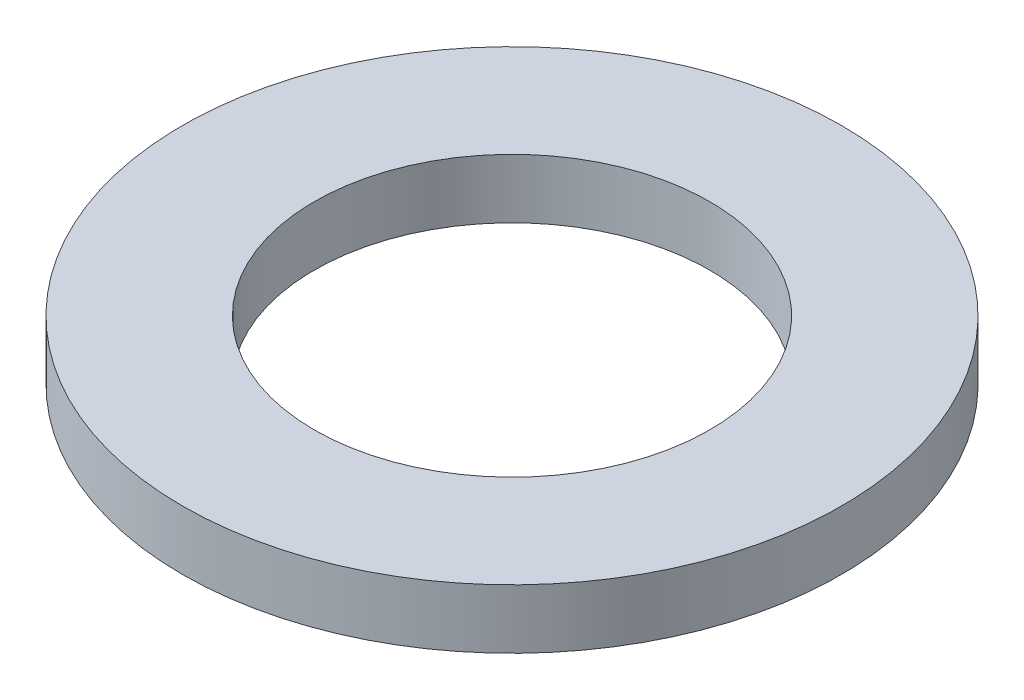
ISO-10303-21;
HEADER;
FILE_DESCRIPTION(('STEP AP214'),'2;1');
FILE_NAME('part.step','',(''),(''),'','','');
FILE_SCHEMA(('AUTOMOTIVE_DESIGN { 1 0 10303 214 1 1 1 1 }'));
ENDSEC;
DATA;
#1=APPLICATION_CONTEXT('core data for automotive mechanical design processes');
#2=APPLICATION_PROTOCOL_DEFINITION('international standard','automotive_design',2000,#1);
#3=PRODUCT_CONTEXT('',#1,'mechanical');
#4=PRODUCT('Part','Part','',(#3));
#5=PRODUCT_RELATED_PRODUCT_CATEGORY('part','',(#4));
#6=PRODUCT_DEFINITION_FORMATION('','',#4);
#7=PRODUCT_DEFINITION_CONTEXT('part definition',#1,'design');
#8=PRODUCT_DEFINITION('design','',#6,#7);
#9=PRODUCT_DEFINITION_SHAPE('','',#8);
#10=(LENGTH_UNIT() NAMED_UNIT(*) SI_UNIT(.MILLI.,.METRE.));
#11=(NAMED_UNIT(*) PLANE_ANGLE_UNIT() SI_UNIT($,.RADIAN.));
#12=(NAMED_UNIT(*) SI_UNIT($,.STERADIAN.) SOLID_ANGLE_UNIT());
#13=UNCERTAINTY_MEASURE_WITH_UNIT(LENGTH_MEASURE(1.E-05),#10,'distance_accuracy_value','');
#14=(GEOMETRIC_REPRESENTATION_CONTEXT(3) GLOBAL_UNCERTAINTY_ASSIGNED_CONTEXT((#13)) GLOBAL_UNIT_ASSIGNED_CONTEXT((#10,
#11,#12)) REPRESENTATION_CONTEXT('',''));
#15=CARTESIAN_POINT('',(0.,0.,0.));
#16=DIRECTION('',(0.,0.,1.));
#17=DIRECTION('',(1.,0.,0.));
#18=AXIS2_PLACEMENT_3D('',#15,#16,#17);
#19=CARTESIAN_POINT('',(0.,9.,0.));
#20=DIRECTION('',(0.,-1.,0.));
#21=DIRECTION('',(0.,0.,-1.));
#22=AXIS2_PLACEMENT_3D('',#19,#20,#21);
#23=CYLINDRICAL_SURFACE('',#22,50.);
#24=CARTESIAN_POINT('',(0.,9.,0.));
#25=DIRECTION('',(0.,1.,0.));
#26=DIRECTION('',(0.,0.,1.));
#27=AXIS2_PLACEMENT_3D('',#24,#25,#26);
#28=CIRCLE('',#27,50.);
#29=CARTESIAN_POINT('',(0.,9.,50.));
#30=VERTEX_POINT('',#29);
#31=EDGE_CURVE('E10',#30,#30,#28,.T.);
#32=ORIENTED_EDGE('',*,*,#31,.F.);
#33=EDGE_LOOP('',(#32));
#34=FACE_BOUND('',#33,.T.);
#35=CARTESIAN_POINT('',(0.,0.,0.));
#36=DIRECTION('',(0.,1.,0.));
#37=DIRECTION('',(0.,0.,1.));
#38=AXIS2_PLACEMENT_3D('',#35,#36,#37);
#39=CIRCLE('',#38,50.);
#40=CARTESIAN_POINT('',(0.,0.,50.));
#41=VERTEX_POINT('',#40);
#42=EDGE_CURVE('E37',#41,#41,#39,.T.);
#43=ORIENTED_EDGE('',*,*,#42,.T.);
#44=EDGE_LOOP('',(#43));
#45=FACE_BOUND('',#44,.T.);
#46=ADVANCED_FACE('F40',(#34,#45),#23,.T.);
#47=CARTESIAN_POINT('',(0.,9.,0.));
#48=DIRECTION('',(0.,1.,0.));
#49=DIRECTION('',(0.,0.,1.));
#50=AXIS2_PLACEMENT_3D('',#47,#48,#49);
#51=PLANE('',#50);
#52=CARTESIAN_POINT('',(0.,9.,0.));
#53=DIRECTION('',(0.,1.,0.));
#54=DIRECTION('',(0.,0.,1.));
#55=AXIS2_PLACEMENT_3D('',#52,#53,#54);
#56=CIRCLE('',#55,30.);
#57=CARTESIAN_POINT('',(0.,9.,30.));
#58=VERTEX_POINT('',#57);
#59=EDGE_CURVE('E50',#58,#58,#56,.T.);
#60=ORIENTED_EDGE('',*,*,#59,.F.);
#61=EDGE_LOOP('',(#60));
#62=FACE_BOUND('',#61,.T.);
#63=ORIENTED_EDGE('',*,*,#31,.T.);
#64=EDGE_LOOP('',(#63));
#65=FACE_BOUND('',#64,.T.);
#66=ADVANCED_FACE('F59',(#62,#65),#51,.T.);
#67=CARTESIAN_POINT('',(0.,0.,0.));
#68=DIRECTION('',(0.,1.,0.));
#69=DIRECTION('',(0.,0.,1.));
#70=AXIS2_PLACEMENT_3D('',#67,#68,#69);
#71=PLANE('',#70);
#72=CARTESIAN_POINT('',(0.,0.,0.));
#73=DIRECTION('',(0.,1.,0.));
#74=DIRECTION('',(0.,0.,1.));
#75=AXIS2_PLACEMENT_3D('',#72,#73,#74);
#76=CIRCLE('',#75,30.);
#77=CARTESIAN_POINT('',(0.,0.,30.));
#78=VERTEX_POINT('',#77);
#79=EDGE_CURVE('E47',#78,#78,#76,.T.);
#80=ORIENTED_EDGE('',*,*,#79,.T.);
#81=EDGE_LOOP('',(#80));
#82=FACE_BOUND('',#81,.T.);
#83=ORIENTED_EDGE('',*,*,#42,.F.);
#84=EDGE_LOOP('',(#83));
#85=FACE_BOUND('',#84,.T.);
#86=ADVANCED_FACE('F58',(#82,#85),#71,.F.);
#87=CARTESIAN_POINT('',(0.,9.,0.));
#88=DIRECTION('',(0.,-1.,0.));
#89=DIRECTION('',(0.,0.,-1.));
#90=AXIS2_PLACEMENT_3D('',#87,#88,#89);
#91=CYLINDRICAL_SURFACE('',#90,30.);
#92=ORIENTED_EDGE('',*,*,#59,.T.);
#93=EDGE_LOOP('',(#92));
#94=FACE_BOUND('',#93,.T.);
#95=ORIENTED_EDGE('',*,*,#79,.F.);
#96=EDGE_LOOP('',(#95));
#97=FACE_BOUND('',#96,.T.);
#98=ADVANCED_FACE('F54',(#94,#97),#91,.F.);
#99=CLOSED_SHELL('',(#46,#66,#86,#98));
#100=MANIFOLD_SOLID_BREP('B2',#99);
#101=ADVANCED_BREP_SHAPE_REPRESENTATION('',(#18,#100),#14);
#102=SHAPE_DEFINITION_REPRESENTATION(#9,#101);
ENDSEC;
END-ISO-10303-21;
